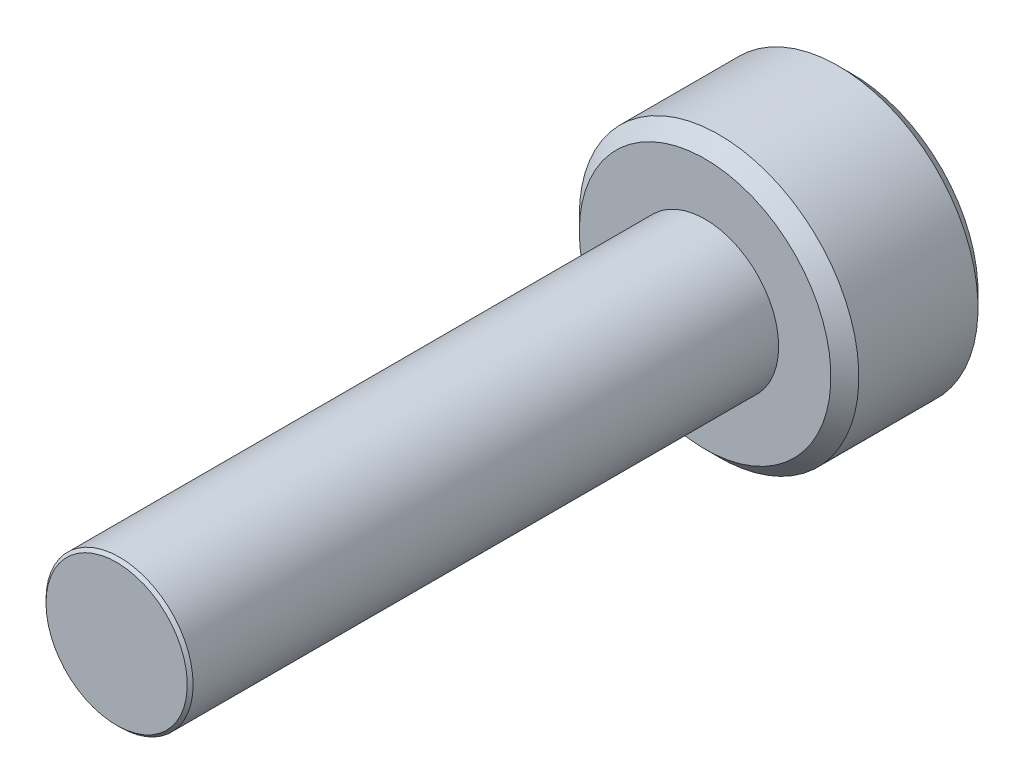
ISO-10303-21;
HEADER;
FILE_DESCRIPTION(('STEP AP214'),'2;1');
FILE_NAME('part.step','',(''),(''),'','','');
FILE_SCHEMA(('AUTOMOTIVE_DESIGN { 1 0 10303 214 1 1 1 1 }'));
ENDSEC;
DATA;
#1=APPLICATION_CONTEXT('core data for automotive mechanical design processes');
#2=APPLICATION_PROTOCOL_DEFINITION('international standard','automotive_design',2000,#1);
#3=PRODUCT_CONTEXT('',#1,'mechanical');
#4=PRODUCT('Part','Part','',(#3));
#5=PRODUCT_RELATED_PRODUCT_CATEGORY('part','',(#4));
#6=PRODUCT_DEFINITION_FORMATION('','',#4);
#7=PRODUCT_DEFINITION_CONTEXT('part definition',#1,'design');
#8=PRODUCT_DEFINITION('design','',#6,#7);
#9=PRODUCT_DEFINITION_SHAPE('','',#8);
#10=(LENGTH_UNIT() NAMED_UNIT(*) SI_UNIT(.MILLI.,.METRE.));
#11=(NAMED_UNIT(*) PLANE_ANGLE_UNIT() SI_UNIT($,.RADIAN.));
#12=(NAMED_UNIT(*) SI_UNIT($,.STERADIAN.) SOLID_ANGLE_UNIT());
#13=UNCERTAINTY_MEASURE_WITH_UNIT(LENGTH_MEASURE(1.E-05),#10,'distance_accuracy_value','');
#14=(GEOMETRIC_REPRESENTATION_CONTEXT(3) GLOBAL_UNCERTAINTY_ASSIGNED_CONTEXT((#13)) GLOBAL_UNIT_ASSIGNED_CONTEXT((#10,
#11,#12)) REPRESENTATION_CONTEXT('',''));
#15=CARTESIAN_POINT('',(0.,0.,0.));
#16=DIRECTION('',(0.,0.,1.));
#17=DIRECTION('',(1.,0.,0.));
#18=AXIS2_PLACEMENT_3D('',#15,#16,#17);
#19=CARTESIAN_POINT('',(0.,0.,-8.));
#20=DIRECTION('',(0.,0.,-1.));
#21=DIRECTION('',(-1.,0.,0.));
#22=AXIS2_PLACEMENT_3D('',#19,#20,#21);
#23=PLANE('',#22);
#24=CARTESIAN_POINT('',(0.,0.,-8.));
#25=DIRECTION('',(0.,0.,-1.));
#26=DIRECTION('',(-1.,0.,0.));
#27=AXIS2_PLACEMENT_3D('',#24,#25,#26);
#28=CIRCLE('',#27,1.71);
#29=CARTESIAN_POINT('',(-1.71,0.,-8.));
#30=VERTEX_POINT('',#29);
#31=EDGE_CURVE('E11',#30,#30,#28,.F.);
#32=ORIENTED_EDGE('',*,*,#31,.T.);
#33=EDGE_LOOP('',(#32));
#34=FACE_BOUND('',#33,.T.);
#35=CARTESIAN_POINT('',(0.,0.,-8.));
#36=DIRECTION('',(0.,0.,1.));
#37=DIRECTION('',(1.,0.,0.));
#38=AXIS2_PLACEMENT_3D('',#35,#36,#37);
#39=CIRCLE('',#38,1.);
#40=CARTESIAN_POINT('',(1.,0.,-8.));
#41=VERTEX_POINT('',#40);
#42=EDGE_CURVE('E118',#41,#41,#39,.T.);
#43=ORIENTED_EDGE('',*,*,#42,.F.);
#44=EDGE_LOOP('',(#43));
#45=FACE_BOUND('',#44,.T.);
#46=ADVANCED_FACE('F41',(#34,#45),#23,.F.);
#47=CARTESIAN_POINT('',(0.,0.,-8.));
#48=DIRECTION('',(0.,0.,1.));
#49=DIRECTION('',(1.,0.,0.));
#50=AXIS2_PLACEMENT_3D('',#47,#48,#49);
#51=CYLINDRICAL_SURFACE('',#50,1.);
#52=ORIENTED_EDGE('',*,*,#42,.T.);
#53=EDGE_LOOP('',(#52));
#54=FACE_BOUND('',#53,.T.);
#55=CARTESIAN_POINT('',(0.,0.,-0.0399999999999988));
#56=DIRECTION('',(0.,0.,1.));
#57=DIRECTION('',(1.,0.,0.));
#58=AXIS2_PLACEMENT_3D('',#55,#56,#57);
#59=CIRCLE('',#58,1.);
#60=CARTESIAN_POINT('',(-1.,0.,-0.0399999999999988));
#61=VERTEX_POINT('',#60);
#62=EDGE_CURVE('E146',#61,#61,#59,.F.);
#63=ORIENTED_EDGE('',*,*,#62,.T.);
#64=EDGE_LOOP('',(#63));
#65=FACE_BOUND('',#64,.T.);
#66=ADVANCED_FACE('F212',(#54,#65),#51,.T.);
#67=CARTESIAN_POINT('',(0.,0.,-10.));
#68=DIRECTION('',(0.,0.,1.));
#69=DIRECTION('',(1.,0.,0.));
#70=AXIS2_PLACEMENT_3D('',#67,#68,#69);
#71=CYLINDRICAL_SURFACE('',#70,1.9);
#72=CARTESIAN_POINT('',(0.,0.,-9.81));
#73=DIRECTION('',(0.,0.,-1.));
#74=DIRECTION('',(-1.,0.,0.));
#75=AXIS2_PLACEMENT_3D('',#72,#73,#74);
#76=CIRCLE('',#75,1.9);
#77=CARTESIAN_POINT('',(-1.9,0.,-9.81));
#78=VERTEX_POINT('',#77);
#79=EDGE_CURVE('E50',#78,#78,#76,.F.);
#80=ORIENTED_EDGE('',*,*,#79,.T.);
#81=EDGE_LOOP('',(#80));
#82=FACE_BOUND('',#81,.T.);
#83=CARTESIAN_POINT('',(0.,0.,-8.19));
#84=DIRECTION('',(0.,0.,-1.));
#85=DIRECTION('',(-1.,0.,0.));
#86=AXIS2_PLACEMENT_3D('',#83,#84,#85);
#87=CIRCLE('',#86,1.9);
#88=CARTESIAN_POINT('',(-1.9,0.,-8.19));
#89=VERTEX_POINT('',#88);
#90=EDGE_CURVE('E190',#89,#89,#87,.T.);
#91=ORIENTED_EDGE('',*,*,#90,.T.);
#92=EDGE_LOOP('',(#91));
#93=FACE_BOUND('',#92,.T.);
#94=ADVANCED_FACE('F197',(#82,#93),#71,.T.);
#95=CARTESIAN_POINT('',(0.,0.,-10.));
#96=DIRECTION('',(0.,0.,-1.));
#97=DIRECTION('',(-1.,0.,0.));
#98=AXIS2_PLACEMENT_3D('',#95,#96,#97);
#99=PLANE('',#98);
#100=CARTESIAN_POINT('',(0.,0.,-10.));
#101=DIRECTION('',(0.,0.,-1.));
#102=DIRECTION('',(-1.,0.,0.));
#103=AXIS2_PLACEMENT_3D('',#100,#101,#102);
#104=CIRCLE('',#103,1.71);
#105=CARTESIAN_POINT('',(-1.71,0.,-10.));
#106=VERTEX_POINT('',#105);
#107=EDGE_CURVE('E117',#106,#106,#104,.T.);
#108=ORIENTED_EDGE('',*,*,#107,.T.);
#109=EDGE_LOOP('',(#108));
#110=FACE_BOUND('',#109,.T.);
#111=CARTESIAN_POINT('',(0.,0.,-10.));
#112=DIRECTION('',(0.,0.,-1.));
#113=DIRECTION('',(-1.,0.,0.));
#114=AXIS2_PLACEMENT_3D('',#111,#112,#113);
#115=CIRCLE('',#114,0.866025403784438);
#116=CARTESIAN_POINT('',(-0.749999999999999,0.43301270189222,-10.));
#117=VERTEX_POINT('',#116);
#118=CARTESIAN_POINT('',(0.,0.866025403784438,-10.));
#119=VERTEX_POINT('',#118);
#120=EDGE_CURVE('E96',#117,#119,#115,.T.);
#121=ORIENTED_EDGE('',*,*,#120,.F.);
#122=CARTESIAN_POINT('',(-0.749999999999999,-0.43301270189222,-10.));
#123=VERTEX_POINT('',#122);
#124=EDGE_CURVE('E56',#123,#117,#115,.T.);
#125=ORIENTED_EDGE('',*,*,#124,.F.);
#126=CARTESIAN_POINT('',(0.,-0.866025403784438,-10.));
#127=VERTEX_POINT('',#126);
#128=EDGE_CURVE('E242',#127,#123,#115,.T.);
#129=ORIENTED_EDGE('',*,*,#128,.F.);
#130=CARTESIAN_POINT('',(0.75,-0.433012701892219,-10.));
#131=VERTEX_POINT('',#130);
#132=EDGE_CURVE('E63',#131,#127,#115,.T.);
#133=ORIENTED_EDGE('',*,*,#132,.F.);
#134=CARTESIAN_POINT('',(0.749999999999999,0.43301270189222,-10.));
#135=VERTEX_POINT('',#134);
#136=EDGE_CURVE('E141',#135,#131,#115,.T.);
#137=ORIENTED_EDGE('',*,*,#136,.F.);
#138=EDGE_CURVE('E106',#119,#135,#115,.T.);
#139=ORIENTED_EDGE('',*,*,#138,.F.);
#140=EDGE_LOOP('',(#121,#125,#129,#133,#137,#139));
#141=FACE_BOUND('',#140,.T.);
#142=ADVANCED_FACE('F140',(#110,#141),#99,.T.);
#143=CARTESIAN_POINT('',(0.,0.,-10.));
#144=DIRECTION('',(0.,0.,-1.));
#145=DIRECTION('',(-1.,0.,0.));
#146=AXIS2_PLACEMENT_3D('',#143,#144,#145);
#147=CONICAL_SURFACE('',#146,0.866025403784438,0.78539816339745);
#148=ORIENTED_EDGE('',*,*,#138,.T.);
#149=CARTESIAN_POINT('',(-0.000199999999999593,0.866140873838276,-10.0001154931448));
#150=CARTESIAN_POINT('',(0.025589962557682,0.851251032013208,-9.98523411046392));
#151=CARTESIAN_POINT('',(0.0518112021286597,0.836112192288419,-9.97122626560696));
#152=CARTESIAN_POINT('',(0.105279708235707,0.805242135894348,-9.94557752468226));
#153=CARTESIAN_POINT('',(0.132532067460573,0.789507978959819,-9.93395091170567));
#154=CARTESIAN_POINT('',(0.187485350381353,0.757780686272653,-9.91403404577224));
#155=CARTESIAN_POINT('',(0.21517225669551,0.741795643459147,-9.90569369408137));
#156=CARTESIAN_POINT('',(0.271155595130853,0.709473647943367,-9.89284274196143));
#157=CARTESIAN_POINT('',(0.299450314843645,0.693137683900542,-9.88832254058884));
#158=CARTESIAN_POINT('',(0.348210289268843,0.664986099540475,-9.88424583309744));
#159=CARTESIAN_POINT('',(0.368612065655572,0.65320712845165,-9.88364279661408));
#160=CARTESIAN_POINT('',(0.40937613469636,0.629671982217687,-9.88465450601553));
#161=CARTESIAN_POINT('',(0.429738417651455,0.617915812672247,-9.88626974099003));
#162=CARTESIAN_POINT('',(0.490534543086824,0.582815153286451,-9.89433614697304));
#163=CARTESIAN_POINT('',(0.530665854996099,0.559645329552698,-9.90400893582772));
#164=CARTESIAN_POINT('',(0.601110400354026,0.518974152327358,-9.92735631797231));
#165=CARTESIAN_POINT('',(0.631753572009086,0.501282308923485,-9.93980855807225));
#166=CARTESIAN_POINT('',(0.691839345804789,0.466591771248069,-9.96785961023086));
#167=CARTESIAN_POINT('',(0.72128548838159,0.449591032904757,-9.98344818590375));
#168=CARTESIAN_POINT('',(0.7502,0.432897231838382,-10.0001154931448));
#169=B_SPLINE_CURVE_WITH_KNOTS('',3,(#149,#150,#151,#152,#153,#154,#155,#156,#157,#158,#159,
#160,#161,#162,#163,#164,#165,#166,#167,#168),.UNSPECIFIED.,.F.,.F.,(4,2,2,2,2,2,2,2,2,4),(0.,
0.0999419466095601,0.200466857654446,0.299393763705717,0.39807129730023,0.468665775681747,
0.539275821398839,0.680536257244566,0.792918418368073,0.904939568716031),.UNSPECIFIED.);
#170=EDGE_CURVE('E111',#119,#135,#169,.T.);
#171=ORIENTED_EDGE('',*,*,#170,.F.);
#172=EDGE_LOOP('',(#148,#171));
#173=FACE_BOUND('',#172,.T.);
#174=ADVANCED_FACE('F112',(#173),#147,.F.);
#175=ORIENTED_EDGE('',*,*,#136,.T.);
#176=CARTESIAN_POINT('',(0.75,-0.863604064974112,-10.2777892582303));
#177=CARTESIAN_POINT('',(0.75,-0.842575879856458,-10.2619149320996));
#178=CARTESIAN_POINT('',(0.75,-0.82143049641015,-10.2461962652706));
#179=CARTESIAN_POINT('',(0.75,-0.7788578575305,-10.2151345207069));
#180=CARTESIAN_POINT('',(0.75,-0.757430533150144,-10.1997915375702));
#181=CARTESIAN_POINT('',(0.75,-0.69234071080991,-10.1542035803594));
#182=CARTESIAN_POINT('',(0.75,-0.648190081142954,-10.1246440918019));
#183=CARTESIAN_POINT('',(0.75,-0.555607181575076,-10.0666155827363));
#184=CARTESIAN_POINT('',(0.75,-0.507074363082498,-10.0383051094017));
#185=CARTESIAN_POINT('',(0.75,-0.407587529818442,-9.98651811179061));
#186=CARTESIAN_POINT('',(0.75,-0.356642419585008,-9.96302529154705));
#187=CARTESIAN_POINT('',(0.75,-0.280165468850111,-9.93428689951103));
#188=CARTESIAN_POINT('',(0.75,-0.255770023962927,-9.9260392748236));
#189=CARTESIAN_POINT('',(0.75,-0.206403277923611,-9.91149717543051));
#190=CARTESIAN_POINT('',(0.75,-0.181431937227496,-9.90520283527902));
#191=CARTESIAN_POINT('',(0.75,-0.10669987945563,-9.88999317388815));
#192=CARTESIAN_POINT('',(0.75,-0.0561907172329782,-9.88437718471751));
#193=CARTESIAN_POINT('',(0.75,0.0430767231074191,-9.88362825645083));
#194=CARTESIAN_POINT('',(0.75,0.0918322433444378,-9.88812345139702));
#195=CARTESIAN_POINT('',(0.75,0.164112195619626,-9.90133730742922));
#196=CARTESIAN_POINT('',(0.75,0.188278676798617,-9.90690144636243));
#197=CARTESIAN_POINT('',(0.75,0.236094480035413,-9.91992316612325));
#198=CARTESIAN_POINT('',(0.75,0.259743845186176,-9.92738058851924));
#199=CARTESIAN_POINT('',(0.75,0.334198278358037,-9.95366646942379));
#200=CARTESIAN_POINT('',(0.75,0.383940060323694,-9.97549033799338));
#201=CARTESIAN_POINT('',(0.75,0.481089224924055,-10.0240118040186));
#202=CARTESIAN_POINT('',(0.75,0.528487417805623,-10.0507269112141));
#203=CARTESIAN_POINT('',(0.75,0.619071540271279,-10.1058428510274));
#204=CARTESIAN_POINT('',(0.75,0.662349745094377,-10.134093945316));
#205=CARTESIAN_POINT('',(0.75,0.726111622992782,-10.1777671469421));
#206=CARTESIAN_POINT('',(0.75,0.747090419026061,-10.1924788603549));
#207=CARTESIAN_POINT('',(0.75,0.788761341261127,-10.222291383928));
#208=CARTESIAN_POINT('',(0.75,0.809453544289149,-10.2373920865822));
#209=CARTESIAN_POINT('',(0.75,0.830026389845271,-10.2526540891176));
#210=B_SPLINE_CURVE_WITH_KNOTS('',3,(#176,#177,#178,#179,#180,#181,#182,#183,#184,#185,#186,
#187,#188,#189,#190,#191,#192,#193,#194,#195,#196,#197,#198,#199,#200,#201,#202,#203,#204,#205,
#206,#207,#208,#209),.UNSPECIFIED.,.F.,.F.,(4,2,2,2,2,2,2,2,2,2,2,2,2,2,2,2,4),(0.,
0.0790398443275114,0.158099390527685,0.317425208734853,0.485845155776513,0.653685658433149,
0.73086980575654,0.808059268815782,0.959469653475935,1.1054029045548,1.1797320311882,
1.25405493994416,1.41653726506484,1.57961304282019,1.73458511685198,1.81145152919337,
1.88829692100168),.UNSPECIFIED.);
#211=EDGE_CURVE('E105',#135,#131,#210,.F.);
#212=ORIENTED_EDGE('',*,*,#211,.F.);
#213=EDGE_LOOP('',(#175,#212));
#214=FACE_BOUND('',#213,.T.);
#215=ADVANCED_FACE('F211',(#214),#147,.F.);
#216=ORIENTED_EDGE('',*,*,#132,.T.);
#217=CARTESIAN_POINT('',(0.7502,-0.432897231838382,-10.0001154931448));
#218=CARTESIAN_POINT('',(0.724410037442318,-0.44778707366345,-9.98523411046392));
#219=CARTESIAN_POINT('',(0.69818879787134,-0.462925913388239,-9.97122626560696));
#220=CARTESIAN_POINT('',(0.644720291764293,-0.49379596978231,-9.94557752468226));
#221=CARTESIAN_POINT('',(0.617467932539427,-0.509530126716839,-9.93395091170567));
#222=CARTESIAN_POINT('',(0.562514649618646,-0.541257419404005,-9.91403404577224));
#223=CARTESIAN_POINT('',(0.53482774330449,-0.557242462217512,-9.90569369408137));
#224=CARTESIAN_POINT('',(0.478844404869146,-0.589564457733291,-9.89284274196143));
#225=CARTESIAN_POINT('',(0.450549685156354,-0.605900421776116,-9.88832254058884));
#226=CARTESIAN_POINT('',(0.401789710731156,-0.634052006136184,-9.88424583309744));
#227=CARTESIAN_POINT('',(0.381387934344427,-0.645830977225009,-9.88364279661408));
#228=CARTESIAN_POINT('',(0.340623865303639,-0.669366123458972,-9.88465450601553));
#229=CARTESIAN_POINT('',(0.320261582348544,-0.681122293004411,-9.88626974099003));
#230=CARTESIAN_POINT('',(0.259465456913175,-0.716222952390208,-9.89433614697304));
#231=CARTESIAN_POINT('',(0.2193341450039,-0.73939277612396,-9.90400893582772));
#232=CARTESIAN_POINT('',(0.148889599645974,-0.7800639533493,-9.92735631797231));
#233=CARTESIAN_POINT('',(0.118246427990913,-0.797755796753173,-9.93980855807225));
#234=CARTESIAN_POINT('',(0.0581606541952102,-0.83244633442859,-9.96785961023086));
#235=CARTESIAN_POINT('',(0.0287145116184093,-0.849447072771901,-9.98344818590375));
#236=CARTESIAN_POINT('',(-0.000199999999999743,-0.866140873838276,-10.0001154931448));
#237=B_SPLINE_CURVE_WITH_KNOTS('',3,(#217,#218,#219,#220,#221,#222,#223,#224,#225,#226,#227,
#228,#229,#230,#231,#232,#233,#234,#235,#236),.UNSPECIFIED.,.F.,.F.,(4,2,2,2,2,2,2,2,2,4),(0.,
0.0999419466095608,0.200466857654447,0.299393763705718,0.398071297300231,0.468665775681748,
0.53927582139884,0.680536257244567,0.792918418368074,0.904939568716032),.UNSPECIFIED.);
#238=EDGE_CURVE('E157',#131,#127,#237,.T.);
#239=ORIENTED_EDGE('',*,*,#238,.F.);
#240=EDGE_LOOP('',(#216,#239));
#241=FACE_BOUND('',#240,.T.);
#242=ADVANCED_FACE('F334',(#241),#147,.F.);
#243=ORIENTED_EDGE('',*,*,#128,.T.);
#244=CARTESIAN_POINT('',(0.000200000000000017,-0.866140873838277,-10.0001154931448));
#245=CARTESIAN_POINT('',(-0.0255899625576813,-0.851251032013209,-9.98523411046392));
#246=CARTESIAN_POINT('',(-0.0518112021286592,-0.836112192288419,-9.97122626560696));
#247=CARTESIAN_POINT('',(-0.105279708235707,-0.805242135894348,-9.94557752468226));
#248=CARTESIAN_POINT('',(-0.132532067460573,-0.789507978959819,-9.93395091170567));
#249=CARTESIAN_POINT('',(-0.187485350381353,-0.757780686272653,-9.91403404577225));
#250=CARTESIAN_POINT('',(-0.21517225669551,-0.741795643459147,-9.90569369408137));
#251=CARTESIAN_POINT('',(-0.271155595130853,-0.709473647943367,-9.89284274196143));
#252=CARTESIAN_POINT('',(-0.299450314843645,-0.693137683900542,-9.88832254058884));
#253=CARTESIAN_POINT('',(-0.348210289268844,-0.664986099540474,-9.88424583309744));
#254=CARTESIAN_POINT('',(-0.368612065655573,-0.65320712845165,-9.88364279661408));
#255=CARTESIAN_POINT('',(-0.409376134696361,-0.629671982217687,-9.88465450601553));
#256=CARTESIAN_POINT('',(-0.429738417651456,-0.617915812672247,-9.88626974099003));
#257=CARTESIAN_POINT('',(-0.490534543086824,-0.582815153286451,-9.89433614697304));
#258=CARTESIAN_POINT('',(-0.5306658549961,-0.559645329552698,-9.90400893582772));
#259=CARTESIAN_POINT('',(-0.601110400354026,-0.518974152327358,-9.92735631797231));
#260=CARTESIAN_POINT('',(-0.631753572009087,-0.501282308923485,-9.93980855807225));
#261=CARTESIAN_POINT('',(-0.69183934580479,-0.466591771248069,-9.96785961023086));
#262=CARTESIAN_POINT('',(-0.72128548838159,-0.449591032904757,-9.98344818590375));
#263=CARTESIAN_POINT('',(-0.750199999999999,-0.432897231838382,-10.0001154931448));
#264=B_SPLINE_CURVE_WITH_KNOTS('',3,(#244,#245,#246,#247,#248,#249,#250,#251,#252,#253,#254,
#255,#256,#257,#258,#259,#260,#261,#262,#263),.UNSPECIFIED.,.F.,.F.,(4,2,2,2,2,2,2,2,2,4),(0.,
0.0999419466095603,0.200466857654446,0.299393763705717,0.398071297300231,0.468665775681748,
0.53927582139884,0.680536257244567,0.792918418368073,0.904939568716031),.UNSPECIFIED.);
#265=EDGE_CURVE('E250',#127,#123,#264,.T.);
#266=ORIENTED_EDGE('',*,*,#265,.F.);
#267=EDGE_LOOP('',(#243,#266));
#268=FACE_BOUND('',#267,.T.);
#269=ADVANCED_FACE('F248',(#268),#147,.F.);
#270=ORIENTED_EDGE('',*,*,#124,.T.);
#271=CARTESIAN_POINT('',(-0.749999999999999,-0.863604064974114,-10.2777892582303));
#272=CARTESIAN_POINT('',(-0.749999999999999,-0.842575879856459,-10.2619149320996));
#273=CARTESIAN_POINT('',(-0.749999999999999,-0.82143049641015,-10.2461962652706));
#274=CARTESIAN_POINT('',(-0.749999999999999,-0.7788578575305,-10.2151345207069));
#275=CARTESIAN_POINT('',(-0.749999999999999,-0.757430533150144,-10.1997915375702));
#276=CARTESIAN_POINT('',(-0.749999999999999,-0.692340710809911,-10.1542035803594));
#277=CARTESIAN_POINT('',(-0.749999999999999,-0.648190081142953,-10.1246440918019));
#278=CARTESIAN_POINT('',(-0.749999999999999,-0.555607181575074,-10.0666155827363));
#279=CARTESIAN_POINT('',(-0.749999999999999,-0.507074363082497,-10.0383051094017));
#280=CARTESIAN_POINT('',(-0.749999999999999,-0.407587529818441,-9.98651811179061));
#281=CARTESIAN_POINT('',(-0.749999999999999,-0.356642419585009,-9.96302529154705));
#282=CARTESIAN_POINT('',(-0.749999999999999,-0.280165468850111,-9.93428689951103));
#283=CARTESIAN_POINT('',(-0.749999999999999,-0.255770023962927,-9.9260392748236));
#284=CARTESIAN_POINT('',(-0.749999999999999,-0.206403277923611,-9.91149717543051));
#285=CARTESIAN_POINT('',(-0.749999999999999,-0.181431937227496,-9.90520283527902));
#286=CARTESIAN_POINT('',(-0.749999999999999,-0.10669987945563,-9.88999317388815));
#287=CARTESIAN_POINT('',(-0.749999999999999,-0.056190717232978,-9.88437718471751));
#288=CARTESIAN_POINT('',(-0.749999999999999,0.0430767231074187,-9.88362825645083));
#289=CARTESIAN_POINT('',(-0.749999999999999,0.0918322433444369,-9.88812345139703));
#290=CARTESIAN_POINT('',(-0.749999999999999,0.164112195619625,-9.90133730742922));
#291=CARTESIAN_POINT('',(-0.749999999999999,0.188278676798616,-9.90690144636243));
#292=CARTESIAN_POINT('',(-0.749999999999999,0.236094480035413,-9.91992316612325));
#293=CARTESIAN_POINT('',(-0.749999999999999,0.259743845186175,-9.92738058851924));
#294=CARTESIAN_POINT('',(-0.749999999999999,0.334198278358036,-9.95366646942379));
#295=CARTESIAN_POINT('',(-0.749999999999999,0.383940060323692,-9.97549033799337));
#296=CARTESIAN_POINT('',(-0.749999999999999,0.481089224924053,-10.0240118040186));
#297=CARTESIAN_POINT('',(-0.749999999999999,0.52848741780562,-10.0507269112141));
#298=CARTESIAN_POINT('',(-0.749999999999999,0.619071540271276,-10.1058428510274));
#299=CARTESIAN_POINT('',(-0.749999999999999,0.662349745094374,-10.134093945316));
#300=CARTESIAN_POINT('',(-0.749999999999999,0.726111622992779,-10.1777671469421));
#301=CARTESIAN_POINT('',(-0.749999999999999,0.747090419026059,-10.1924788603549));
#302=CARTESIAN_POINT('',(-0.749999999999999,0.788761341261125,-10.2222913839279));
#303=CARTESIAN_POINT('',(-0.749999999999999,0.809453544289146,-10.2373920865822));
#304=CARTESIAN_POINT('',(-0.749999999999999,0.830026389845267,-10.2526540891176));
#305=B_SPLINE_CURVE_WITH_KNOTS('',3,(#271,#272,#273,#274,#275,#276,#277,#278,#279,#280,#281,
#282,#283,#284,#285,#286,#287,#288,#289,#290,#291,#292,#293,#294,#295,#296,#297,#298,#299,#300,
#301,#302,#303,#304),.UNSPECIFIED.,.F.,.F.,(4,2,2,2,2,2,2,2,2,2,2,2,2,2,2,2,4),(0.,
0.0790398443275135,0.158099390527688,0.317425208734856,0.485845155776516,0.65368565843315,
0.730869805756542,0.808059268815785,0.959469653475937,1.1054029045548,1.17973203118821,
1.25405493994416,1.41653726506484,1.57961304282019,1.73458511685198,1.81145152919337,
1.88829692100168),.UNSPECIFIED.);
#306=EDGE_CURVE('E129',#123,#117,#305,.T.);
#307=ORIENTED_EDGE('',*,*,#306,.F.);
#308=EDGE_LOOP('',(#270,#307));
#309=FACE_BOUND('',#308,.T.);
#310=ADVANCED_FACE('F353',(#309),#147,.F.);
#311=ORIENTED_EDGE('',*,*,#120,.T.);
#312=CARTESIAN_POINT('',(-0.7502,0.432897231838381,-10.0001154931448));
#313=CARTESIAN_POINT('',(-0.724410037442318,0.447787073663449,-9.98523411046392));
#314=CARTESIAN_POINT('',(-0.69818879787134,0.462925913388239,-9.97122626560696));
#315=CARTESIAN_POINT('',(-0.644720291764293,0.49379596978231,-9.94557752468226));
#316=CARTESIAN_POINT('',(-0.617467932539427,0.509530126716839,-9.93395091170567));
#317=CARTESIAN_POINT('',(-0.562514649618647,0.541257419404005,-9.91403404577224));
#318=CARTESIAN_POINT('',(-0.53482774330449,0.557242462217511,-9.90569369408137));
#319=CARTESIAN_POINT('',(-0.478844404869147,0.58956445773329,-9.89284274196143));
#320=CARTESIAN_POINT('',(-0.450549685156355,0.605900421776116,-9.88832254058884));
#321=CARTESIAN_POINT('',(-0.401789710731157,0.634052006136183,-9.88424583309743));
#322=CARTESIAN_POINT('',(-0.381387934344427,0.645830977225008,-9.88364279661408));
#323=CARTESIAN_POINT('',(-0.34062386530364,0.669366123458971,-9.88465450601553));
#324=CARTESIAN_POINT('',(-0.320261582348545,0.681122293004411,-9.88626974099003));
#325=CARTESIAN_POINT('',(-0.259465456913176,0.716222952390207,-9.89433614697304));
#326=CARTESIAN_POINT('',(-0.219334145003901,0.739392776123959,-9.90400893582772));
#327=CARTESIAN_POINT('',(-0.148889599645974,0.780063953349299,-9.92735631797231));
#328=CARTESIAN_POINT('',(-0.118246427990913,0.797755796753173,-9.93980855807225));
#329=CARTESIAN_POINT('',(-0.0581606541952096,0.832446334428589,-9.96785961023086));
#330=CARTESIAN_POINT('',(-0.0287145116184087,0.849447072771901,-9.98344818590375));
#331=CARTESIAN_POINT('',(0.000200000000000486,0.866140873838276,-10.0001154931448));
#332=B_SPLINE_CURVE_WITH_KNOTS('',3,(#312,#313,#314,#315,#316,#317,#318,#319,#320,#321,#322,
#323,#324,#325,#326,#327,#328,#329,#330,#331),.UNSPECIFIED.,.F.,.F.,(4,2,2,2,2,2,2,2,2,4),(0.,
0.0999419466095602,0.200466857654446,0.299393763705718,0.39807129730023,0.468665775681748,
0.53927582139884,0.680536257244566,0.792918418368074,0.904939568716032),.UNSPECIFIED.);
#333=EDGE_CURVE('E100',#117,#119,#332,.T.);
#334=ORIENTED_EDGE('',*,*,#333,.F.);
#335=EDGE_LOOP('',(#311,#334));
#336=FACE_BOUND('',#335,.T.);
#337=ADVANCED_FACE('F98',(#336),#147,.F.);
#338=CARTESIAN_POINT('',(0.749999999999999,1.29903810567666,-8.875));
#339=DIRECTION('',(0.,0.,-1.));
#340=DIRECTION('',(-1.,0.,0.));
#341=AXIS2_PLACEMENT_3D('',#338,#339,#340);
#342=PLANE('',#341);
#343=DIRECTION('',(0.866025403784439,0.5,0.));
#344=VECTOR('',#343,1.);
#345=CARTESIAN_POINT('',(-0.749999999999999,0.433012701892219,-8.875));
#346=LINE('',#345,#344);
#347=CARTESIAN_POINT('',(-0.749999999999999,0.433012701892219,-8.875));
#348=VERTEX_POINT('',#347);
#349=CARTESIAN_POINT('',(0.,0.866025403784438,-8.875));
#350=VERTEX_POINT('',#349);
#351=EDGE_CURVE('E128',#348,#350,#346,.T.);
#352=ORIENTED_EDGE('',*,*,#351,.T.);
#353=DIRECTION('',(0.866025403784439,-0.5,0.));
#354=VECTOR('',#353,1.);
#355=CARTESIAN_POINT('',(0.,0.866025403784438,-8.875));
#356=LINE('',#355,#354);
#357=CARTESIAN_POINT('',(0.75,0.43301270189222,-8.875));
#358=VERTEX_POINT('',#357);
#359=EDGE_CURVE('E133',#350,#358,#356,.T.);
#360=ORIENTED_EDGE('',*,*,#359,.T.);
#361=DIRECTION('',(0.,-1.,0.));
#362=VECTOR('',#361,1.);
#363=CARTESIAN_POINT('',(0.75,0.43301270189222,-8.875));
#364=LINE('',#363,#362);
#365=CARTESIAN_POINT('',(0.75,-0.43301270189222,-8.875));
#366=VERTEX_POINT('',#365);
#367=EDGE_CURVE('E278',#358,#366,#364,.T.);
#368=ORIENTED_EDGE('',*,*,#367,.T.);
#369=DIRECTION('',(-0.866025403784439,-0.5,0.));
#370=VECTOR('',#369,1.);
#371=CARTESIAN_POINT('',(0.75,-0.43301270189222,-8.875));
#372=LINE('',#371,#370);
#373=CARTESIAN_POINT('',(0.,-0.866025403784439,-8.875));
#374=VERTEX_POINT('',#373);
#375=EDGE_CURVE('E281',#366,#374,#372,.T.);
#376=ORIENTED_EDGE('',*,*,#375,.T.);
#377=DIRECTION('',(-0.866025403784439,0.5,0.));
#378=VECTOR('',#377,1.);
#379=CARTESIAN_POINT('',(0.,-0.866025403784439,-8.875));
#380=LINE('',#379,#378);
#381=CARTESIAN_POINT('',(-0.749999999999999,-0.43301270189222,-8.875));
#382=VERTEX_POINT('',#381);
#383=EDGE_CURVE('E264',#374,#382,#380,.T.);
#384=ORIENTED_EDGE('',*,*,#383,.T.);
#385=DIRECTION('',(0.,1.,0.));
#386=VECTOR('',#385,1.);
#387=CARTESIAN_POINT('',(-0.749999999999999,-0.43301270189222,-8.875));
#388=LINE('',#387,#386);
#389=EDGE_CURVE('E137',#382,#348,#388,.T.);
#390=ORIENTED_EDGE('',*,*,#389,.T.);
#391=EDGE_LOOP('',(#352,#360,#368,#376,#384,#390));
#392=FACE_BOUND('',#391,.T.);
#393=ADVANCED_FACE('F178',(#392),#342,.T.);
#394=CARTESIAN_POINT('',(0.,0.866025403784438,-8.875));
#395=DIRECTION('',(0.5,0.866025403784439,0.));
#396=DIRECTION('',(-0.866025403784439,0.5,0.));
#397=AXIS2_PLACEMENT_3D('',#394,#395,#396);
#398=PLANE('',#397);
#399=DIRECTION('',(0.,0.,-1.));
#400=VECTOR('',#399,1.);
#401=CARTESIAN_POINT('',(0.,0.866025403784438,-8.875));
#402=LINE('',#401,#400);
#403=EDGE_CURVE('E124',#350,#119,#402,.T.);
#404=ORIENTED_EDGE('',*,*,#403,.T.);
#405=ORIENTED_EDGE('',*,*,#170,.T.);
#406=DIRECTION('',(0.,0.,-1.));
#407=VECTOR('',#406,1.);
#408=CARTESIAN_POINT('',(0.75,0.43301270189222,-8.875));
#409=LINE('',#408,#407);
#410=EDGE_CURVE('E136',#358,#135,#409,.T.);
#411=ORIENTED_EDGE('',*,*,#410,.F.);
#412=ORIENTED_EDGE('',*,*,#359,.F.);
#413=EDGE_LOOP('',(#404,#405,#411,#412));
#414=FACE_BOUND('',#413,.T.);
#415=ADVANCED_FACE('F131',(#414),#398,.F.);
#416=CARTESIAN_POINT('',(0.75,0.43301270189222,-8.875));
#417=DIRECTION('',(1.,0.,0.));
#418=DIRECTION('',(0.,1.,0.));
#419=AXIS2_PLACEMENT_3D('',#416,#417,#418);
#420=PLANE('',#419);
#421=ORIENTED_EDGE('',*,*,#410,.T.);
#422=ORIENTED_EDGE('',*,*,#211,.T.);
#423=DIRECTION('',(0.,0.,-1.));
#424=VECTOR('',#423,1.);
#425=CARTESIAN_POINT('',(0.75,-0.43301270189222,-8.875));
#426=LINE('',#425,#424);
#427=EDGE_CURVE('E260',#366,#131,#426,.T.);
#428=ORIENTED_EDGE('',*,*,#427,.F.);
#429=ORIENTED_EDGE('',*,*,#367,.F.);
#430=EDGE_LOOP('',(#421,#422,#428,#429));
#431=FACE_BOUND('',#430,.T.);
#432=ADVANCED_FACE('F167',(#431),#420,.F.);
#433=CARTESIAN_POINT('',(0.75,-0.43301270189222,-8.875));
#434=DIRECTION('',(0.5,-0.866025403784439,0.));
#435=DIRECTION('',(0.866025403784439,0.5,0.));
#436=AXIS2_PLACEMENT_3D('',#433,#434,#435);
#437=PLANE('',#436);
#438=ORIENTED_EDGE('',*,*,#427,.T.);
#439=ORIENTED_EDGE('',*,*,#238,.T.);
#440=DIRECTION('',(0.,0.,-1.));
#441=VECTOR('',#440,1.);
#442=CARTESIAN_POINT('',(0.,-0.866025403784439,-8.875));
#443=LINE('',#442,#441);
#444=EDGE_CURVE('E258',#374,#127,#443,.T.);
#445=ORIENTED_EDGE('',*,*,#444,.F.);
#446=ORIENTED_EDGE('',*,*,#375,.F.);
#447=EDGE_LOOP('',(#438,#439,#445,#446));
#448=FACE_BOUND('',#447,.T.);
#449=ADVANCED_FACE('F171',(#448),#437,.F.);
#450=CARTESIAN_POINT('',(0.,-0.866025403784439,-8.875));
#451=DIRECTION('',(-0.5,-0.866025403784439,0.));
#452=DIRECTION('',(0.866025403784439,-0.5,0.));
#453=AXIS2_PLACEMENT_3D('',#450,#451,#452);
#454=PLANE('',#453);
#455=ORIENTED_EDGE('',*,*,#444,.T.);
#456=ORIENTED_EDGE('',*,*,#265,.T.);
#457=DIRECTION('',(0.,0.,-1.));
#458=VECTOR('',#457,1.);
#459=CARTESIAN_POINT('',(-0.749999999999999,-0.43301270189222,-8.875));
#460=LINE('',#459,#458);
#461=EDGE_CURVE('E267',#382,#123,#460,.T.);
#462=ORIENTED_EDGE('',*,*,#461,.F.);
#463=ORIENTED_EDGE('',*,*,#383,.F.);
#464=EDGE_LOOP('',(#455,#456,#462,#463));
#465=FACE_BOUND('',#464,.T.);
#466=ADVANCED_FACE('F262',(#465),#454,.F.);
#467=CARTESIAN_POINT('',(-0.749999999999999,-0.43301270189222,-8.875));
#468=DIRECTION('',(-1.,0.,0.));
#469=DIRECTION('',(0.,-1.,0.));
#470=AXIS2_PLACEMENT_3D('',#467,#468,#469);
#471=PLANE('',#470);
#472=ORIENTED_EDGE('',*,*,#461,.T.);
#473=ORIENTED_EDGE('',*,*,#306,.T.);
#474=DIRECTION('',(0.,0.,-1.));
#475=VECTOR('',#474,1.);
#476=CARTESIAN_POINT('',(-0.749999999999999,0.433012701892219,-8.875));
#477=LINE('',#476,#475);
#478=EDGE_CURVE('E126',#348,#117,#477,.T.);
#479=ORIENTED_EDGE('',*,*,#478,.F.);
#480=ORIENTED_EDGE('',*,*,#389,.F.);
#481=EDGE_LOOP('',(#472,#473,#479,#480));
#482=FACE_BOUND('',#481,.T.);
#483=ADVANCED_FACE('F300',(#482),#471,.F.);
#484=CARTESIAN_POINT('',(-0.749999999999999,0.433012701892219,-8.875));
#485=DIRECTION('',(-0.5,0.866025403784439,0.));
#486=DIRECTION('',(-0.866025403784439,-0.5,0.));
#487=AXIS2_PLACEMENT_3D('',#484,#485,#486);
#488=PLANE('',#487);
#489=ORIENTED_EDGE('',*,*,#478,.T.);
#490=ORIENTED_EDGE('',*,*,#333,.T.);
#491=ORIENTED_EDGE('',*,*,#403,.F.);
#492=ORIENTED_EDGE('',*,*,#351,.F.);
#493=EDGE_LOOP('',(#489,#490,#491,#492));
#494=FACE_BOUND('',#493,.T.);
#495=ADVANCED_FACE('F122',(#494),#488,.F.);
#496=CARTESIAN_POINT('',(0.,0.,-10.));
#497=DIRECTION('',(0.,0.,1.));
#498=DIRECTION('',(1.,0.,0.));
#499=AXIS2_PLACEMENT_3D('',#496,#497,#498);
#500=CONICAL_SURFACE('',#499,1.71,0.785398163397447);
#501=ORIENTED_EDGE('',*,*,#79,.F.);
#502=EDGE_LOOP('',(#501));
#503=FACE_BOUND('',#502,.T.);
#504=ORIENTED_EDGE('',*,*,#107,.F.);
#505=EDGE_LOOP('',(#504));
#506=FACE_BOUND('',#505,.T.);
#507=ADVANCED_FACE('F200',(#503,#506),#500,.T.);
#508=CARTESIAN_POINT('',(0.,0.,-8.19));
#509=DIRECTION('',(0.,0.,-1.));
#510=DIRECTION('',(-1.,0.,0.));
#511=AXIS2_PLACEMENT_3D('',#508,#509,#510);
#512=CONICAL_SURFACE('',#511,1.9,0.785398163397447);
#513=ORIENTED_EDGE('',*,*,#31,.F.);
#514=EDGE_LOOP('',(#513));
#515=FACE_BOUND('',#514,.T.);
#516=ORIENTED_EDGE('',*,*,#90,.F.);
#517=EDGE_LOOP('',(#516));
#518=FACE_BOUND('',#517,.T.);
#519=ADVANCED_FACE('F43',(#515,#518),#512,.T.);
#520=CARTESIAN_POINT('',(0.,0.,0.));
#521=DIRECTION('',(0.,0.,-1.));
#522=DIRECTION('',(-1.,0.,0.));
#523=AXIS2_PLACEMENT_3D('',#520,#521,#522);
#524=CONICAL_SURFACE('',#523,0.960000000000001,0.785398163397454);
#525=CARTESIAN_POINT('',(0.,0.,0.));
#526=DIRECTION('',(0.,0.,1.));
#527=DIRECTION('',(1.,0.,0.));
#528=AXIS2_PLACEMENT_3D('',#525,#526,#527);
#529=CIRCLE('',#528,0.960000000000001);
#530=CARTESIAN_POINT('',(-0.960000000000001,0.,0.));
#531=VERTEX_POINT('',#530);
#532=EDGE_CURVE('E234',#531,#531,#529,.T.);
#533=CARTESIAN_POINT('',(-1.,0.,-0.0399999999999988));
#534=CARTESIAN_POINT('',(-0.999583333333333,0.,-0.0395833333333322));
#535=CARTESIAN_POINT('',(-0.999166666666667,0.,-0.0391666666666655));
#536=CARTESIAN_POINT('',(-0.998333333333334,0.,-0.0383333333333322));
#537=CARTESIAN_POINT('',(-0.997916666666667,0.,-0.0379166666666655));
#538=CARTESIAN_POINT('',(-0.997083333333334,0.,-0.0370833333333322));
#539=CARTESIAN_POINT('',(-0.996666666666667,0.,-0.0366666666666656));
#540=CARTESIAN_POINT('',(-0.995833333333334,0.,-0.0358333333333323));
#541=CARTESIAN_POINT('',(-0.995416666666667,0.,-0.0354166666666656));
#542=CARTESIAN_POINT('',(-0.994583333333333,0.,-0.0345833333333323));
#543=CARTESIAN_POINT('',(-0.994166666666667,0.,-0.0341666666666657));
#544=CARTESIAN_POINT('',(-0.993333333333334,0.,-0.0333333333333324));
#545=CARTESIAN_POINT('',(-0.992916666666667,0.,-0.0329166666666657));
#546=CARTESIAN_POINT('',(-0.992083333333334,0.,-0.0320833333333324));
#547=CARTESIAN_POINT('',(-0.991666666666667,0.,-0.0316666666666657));
#548=CARTESIAN_POINT('',(-0.990833333333334,0.,-0.0308333333333324));
#549=CARTESIAN_POINT('',(-0.990416666666667,0.,-0.0304166666666658));
#550=CARTESIAN_POINT('',(-0.989583333333334,0.,-0.0295833333333325));
#551=CARTESIAN_POINT('',(-0.989166666666667,0.,-0.0291666666666658));
#552=CARTESIAN_POINT('',(-0.988333333333334,0.,-0.0283333333333325));
#553=CARTESIAN_POINT('',(-0.987916666666667,0.,-0.0279166666666658));
#554=CARTESIAN_POINT('',(-0.987083333333334,0.,-0.0270833333333325));
#555=CARTESIAN_POINT('',(-0.986666666666667,0.,-0.0266666666666659));
#556=CARTESIAN_POINT('',(-0.985833333333334,0.,-0.0258333333333326));
#557=CARTESIAN_POINT('',(-0.985416666666667,0.,-0.0254166666666659));
#558=CARTESIAN_POINT('',(-0.984583333333334,0.,-0.0245833333333326));
#559=CARTESIAN_POINT('',(-0.984166666666667,0.,-0.024166666666666));
#560=CARTESIAN_POINT('',(-0.983333333333334,0.,-0.0233333333333327));
#561=CARTESIAN_POINT('',(-0.982916666666667,0.,-0.022916666666666));
#562=CARTESIAN_POINT('',(-0.982083333333334,0.,-0.0220833333333327));
#563=CARTESIAN_POINT('',(-0.981666666666667,0.,-0.021666666666666));
#564=CARTESIAN_POINT('',(-0.980833333333334,0.,-0.0208333333333327));
#565=CARTESIAN_POINT('',(-0.980416666666667,0.,-0.0204166666666661));
#566=CARTESIAN_POINT('',(-0.979583333333334,0.,-0.0195833333333328));
#567=CARTESIAN_POINT('',(-0.979166666666667,0.,-0.0191666666666661));
#568=CARTESIAN_POINT('',(-0.978333333333334,0.,-0.0183333333333328));
#569=CARTESIAN_POINT('',(-0.977916666666667,0.,-0.0179166666666661));
#570=CARTESIAN_POINT('',(-0.977083333333334,0.,-0.0170833333333328));
#571=CARTESIAN_POINT('',(-0.976666666666667,0.,-0.0166666666666662));
#572=CARTESIAN_POINT('',(-0.975833333333334,0.,-0.0158333333333329));
#573=CARTESIAN_POINT('',(-0.975416666666667,0.,-0.0154166666666662));
#574=CARTESIAN_POINT('',(-0.974583333333334,0.,-0.0145833333333329));
#575=CARTESIAN_POINT('',(-0.974166666666667,0.,-0.0141666666666662));
#576=CARTESIAN_POINT('',(-0.973333333333334,0.,-0.0133333333333329));
#577=CARTESIAN_POINT('',(-0.972916666666667,0.,-0.0129166666666663));
#578=CARTESIAN_POINT('',(-0.972083333333334,0.,-0.012083333333333));
#579=CARTESIAN_POINT('',(-0.971666666666667,0.,-0.0116666666666663));
#580=CARTESIAN_POINT('',(-0.970833333333334,0.,-0.010833333333333));
#581=CARTESIAN_POINT('',(-0.970416666666667,0.,-0.0104166666666664));
#582=CARTESIAN_POINT('',(-0.969583333333334,0.,-0.00958333333333305));
#583=CARTESIAN_POINT('',(-0.969166666666667,0.,-0.00916666666666639));
#584=CARTESIAN_POINT('',(-0.968333333333334,0.,-0.00833333333333308));
#585=CARTESIAN_POINT('',(-0.967916666666667,0.,-0.00791666666666642));
#586=CARTESIAN_POINT('',(-0.967083333333334,0.,-0.00708333333333311));
#587=CARTESIAN_POINT('',(-0.966666666666667,0.,-0.00666666666666647));
#588=CARTESIAN_POINT('',(-0.965833333333334,0.,-0.00583333333333317));
#589=CARTESIAN_POINT('',(-0.965416666666667,0.,-0.00541666666666651));
#590=CARTESIAN_POINT('',(-0.964583333333334,0.,-0.00458333333333319));
#591=CARTESIAN_POINT('',(-0.964166666666667,0.,-0.00416666666666653));
#592=CARTESIAN_POINT('',(-0.963333333333334,0.,-0.00333333333333323));
#593=CARTESIAN_POINT('',(-0.962916666666667,0.,-0.00291666666666659));
#594=CARTESIAN_POINT('',(-0.962083333333334,0.,-0.00208333333333328));
#595=CARTESIAN_POINT('',(-0.961666666666667,0.,-0.00166666666666662));
#596=CARTESIAN_POINT('',(-0.960833333333334,0.,-0.000833333333333302));
#597=CARTESIAN_POINT('',(-0.960416666666667,0.,-0.000416666666666642));
#598=CARTESIAN_POINT('',(-0.960000000000001,0.,0.));
#599=B_SPLINE_CURVE_WITH_KNOTS('',3,(#533,#534,#535,#536,#537,#538,#539,#540,#541,#542,#543,
#544,#545,#546,#547,#548,#549,#550,#551,#552,#553,#554,#555,#556,#557,#558,#559,#560,#561,#562,
#563,#564,#565,#566,#567,#568,#569,#570,#571,#572,#573,#574,#575,#576,#577,#578,#579,#580,#581,
#582,#583,#584,#585,#586,#587,#588,#589,#590,#591,#592,#593,#594,#595,#596,#597,#598),
.UNSPECIFIED.,.F.,.F.,(4,2,2,2,2,2,2,2,2,2,2,2,2,2,2,2,2,2,2,2,2,2,2,2,2,2,2,2,2,2,2,2,4),(0.,
0.00176776695296631,0.00353553390593261,0.00530330085889892,0.00707106781186523,
0.00883883476483168,0.010606601717798,0.0123743686707643,0.0141421356237306,0.0159099025766969,
0.0176776695296632,0.0194454364826295,0.0212132034355958,0.0229809703885623,0.0247487373415286,
0.0265165042944949,0.0282842712474612,0.0300520382004275,0.0318198051533938,0.0335875721063602,
0.0353553390593265,0.0371231060122928,0.0388908729652591,0.0406586399182255,0.0424264068711918,
0.0441941738241581,0.0459619407771244,0.0477297077300908,0.0494974746830571,0.0512652416360234,
0.0530330085889898,0.0548007755419561,0.0565685424949224),.UNSPECIFIED.);
#600=EDGE_CURVE('BSEAM226',#61,#531,#599,.T.);
#601=ORIENTED_EDGE('',*,*,#62,.F.);
#602=ORIENTED_EDGE('',*,*,#532,.F.);
#603=ORIENTED_EDGE('',*,*,#600,.T.);
#604=ORIENTED_EDGE('',*,*,#600,.F.);
#605=EDGE_LOOP('',(#601,#603,#602,#604));
#606=FACE_BOUND('',#605,.T.);
#607=ADVANCED_FACE('F226',(#606),#524,.T.);
#608=CARTESIAN_POINT('',(0.,0.,0.));
#609=DIRECTION('',(0.,0.,1.));
#610=DIRECTION('',(1.,0.,0.));
#611=AXIS2_PLACEMENT_3D('',#608,#609,#610);
#612=PLANE('',#611);
#613=ORIENTED_EDGE('',*,*,#532,.T.);
#614=EDGE_LOOP('',(#613));
#615=FACE_BOUND('',#614,.T.);
#616=ADVANCED_FACE('F224',(#615),#612,.T.);
#617=CLOSED_SHELL('',(#46,#66,#94,#142,#174,#215,#242,#269,#310,#337,#393,#415,#432,#449,#466,
#483,#495,#507,#519,#607,#616));
#618=MANIFOLD_SOLID_BREP('B2',#617);
#619=ADVANCED_BREP_SHAPE_REPRESENTATION('',(#18,#618),#14);
#620=SHAPE_DEFINITION_REPRESENTATION(#9,#619);
ENDSEC;
END-ISO-10303-21;
